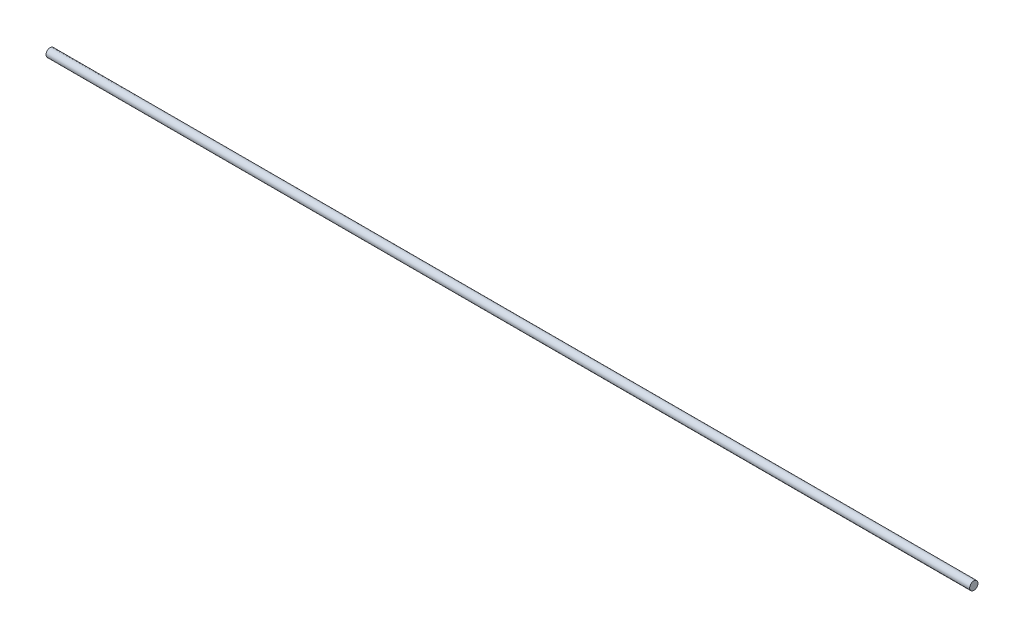
ISO-10303-21;
HEADER;
FILE_DESCRIPTION(('STEP AP214'),'2;1');
FILE_NAME('part.step','',(''),(''),'','','');
FILE_SCHEMA(('AUTOMOTIVE_DESIGN { 1 0 10303 214 1 1 1 1 }'));
ENDSEC;
DATA;
#1=APPLICATION_CONTEXT('core data for automotive mechanical design processes');
#2=APPLICATION_PROTOCOL_DEFINITION('international standard','automotive_design',2000,#1);
#3=PRODUCT_CONTEXT('',#1,'mechanical');
#4=PRODUCT('Part','Part','',(#3));
#5=PRODUCT_RELATED_PRODUCT_CATEGORY('part','',(#4));
#6=PRODUCT_DEFINITION_FORMATION('','',#4);
#7=PRODUCT_DEFINITION_CONTEXT('part definition',#1,'design');
#8=PRODUCT_DEFINITION('design','',#6,#7);
#9=PRODUCT_DEFINITION_SHAPE('','',#8);
#10=(LENGTH_UNIT() NAMED_UNIT(*) SI_UNIT(.MILLI.,.METRE.));
#11=(NAMED_UNIT(*) PLANE_ANGLE_UNIT() SI_UNIT($,.RADIAN.));
#12=(NAMED_UNIT(*) SI_UNIT($,.STERADIAN.) SOLID_ANGLE_UNIT());
#13=UNCERTAINTY_MEASURE_WITH_UNIT(LENGTH_MEASURE(1.E-05),#10,'distance_accuracy_value','');
#14=(GEOMETRIC_REPRESENTATION_CONTEXT(3) GLOBAL_UNCERTAINTY_ASSIGNED_CONTEXT((#13)) GLOBAL_UNIT_ASSIGNED_CONTEXT((#10,
#11,#12)) REPRESENTATION_CONTEXT('',''));
#15=CARTESIAN_POINT('',(0.,0.,0.));
#16=DIRECTION('',(0.,0.,1.));
#17=DIRECTION('',(1.,0.,0.));
#18=AXIS2_PLACEMENT_3D('',#15,#16,#17);
#19=CARTESIAN_POINT('',(100.,0.,0.));
#20=DIRECTION('',(-1.,0.,0.));
#21=DIRECTION('',(0.,0.,1.));
#22=AXIS2_PLACEMENT_3D('',#19,#20,#21);
#23=CYLINDRICAL_SURFACE('',#22,0.45);
#24=CARTESIAN_POINT('',(100.,0.,0.));
#25=DIRECTION('',(1.,0.,0.));
#26=DIRECTION('',(0.,0.,-1.));
#27=AXIS2_PLACEMENT_3D('',#24,#25,#26);
#28=CIRCLE('',#27,0.45);
#29=CARTESIAN_POINT('',(100.,0.,-0.45));
#30=VERTEX_POINT('',#29);
#31=EDGE_CURVE('E10',#30,#30,#28,.T.);
#32=ORIENTED_EDGE('',*,*,#31,.F.);
#33=EDGE_LOOP('',(#32));
#34=FACE_BOUND('',#33,.T.);
#35=CARTESIAN_POINT('',(0.,0.,0.));
#36=DIRECTION('',(1.,0.,0.));
#37=DIRECTION('',(0.,0.,-1.));
#38=AXIS2_PLACEMENT_3D('',#35,#36,#37);
#39=CIRCLE('',#38,0.45);
#40=CARTESIAN_POINT('',(0.,0.,-0.45));
#41=VERTEX_POINT('',#40);
#42=EDGE_CURVE('E39',#41,#41,#39,.T.);
#43=ORIENTED_EDGE('',*,*,#42,.T.);
#44=EDGE_LOOP('',(#43));
#45=FACE_BOUND('',#44,.T.);
#46=ADVANCED_FACE('F36',(#34,#45),#23,.T.);
#47=CARTESIAN_POINT('',(100.,0.,0.));
#48=DIRECTION('',(1.,0.,0.));
#49=DIRECTION('',(0.,0.,-1.));
#50=AXIS2_PLACEMENT_3D('',#47,#48,#49);
#51=PLANE('',#50);
#52=ORIENTED_EDGE('',*,*,#31,.T.);
#53=EDGE_LOOP('',(#52));
#54=FACE_BOUND('',#53,.T.);
#55=ADVANCED_FACE('F51',(#54),#51,.T.);
#56=CARTESIAN_POINT('',(0.,0.,0.));
#57=DIRECTION('',(1.,0.,0.));
#58=DIRECTION('',(0.,0.,-1.));
#59=AXIS2_PLACEMENT_3D('',#56,#57,#58);
#60=PLANE('',#59);
#61=ORIENTED_EDGE('',*,*,#42,.F.);
#62=EDGE_LOOP('',(#61));
#63=FACE_BOUND('',#62,.T.);
#64=ADVANCED_FACE('F49',(#63),#60,.F.);
#65=CLOSED_SHELL('',(#46,#55,#64));
#66=MANIFOLD_SOLID_BREP('B2',#65);
#67=ADVANCED_BREP_SHAPE_REPRESENTATION('',(#18,#66),#14);
#68=SHAPE_DEFINITION_REPRESENTATION(#9,#67);
ENDSEC;
END-ISO-10303-21;
